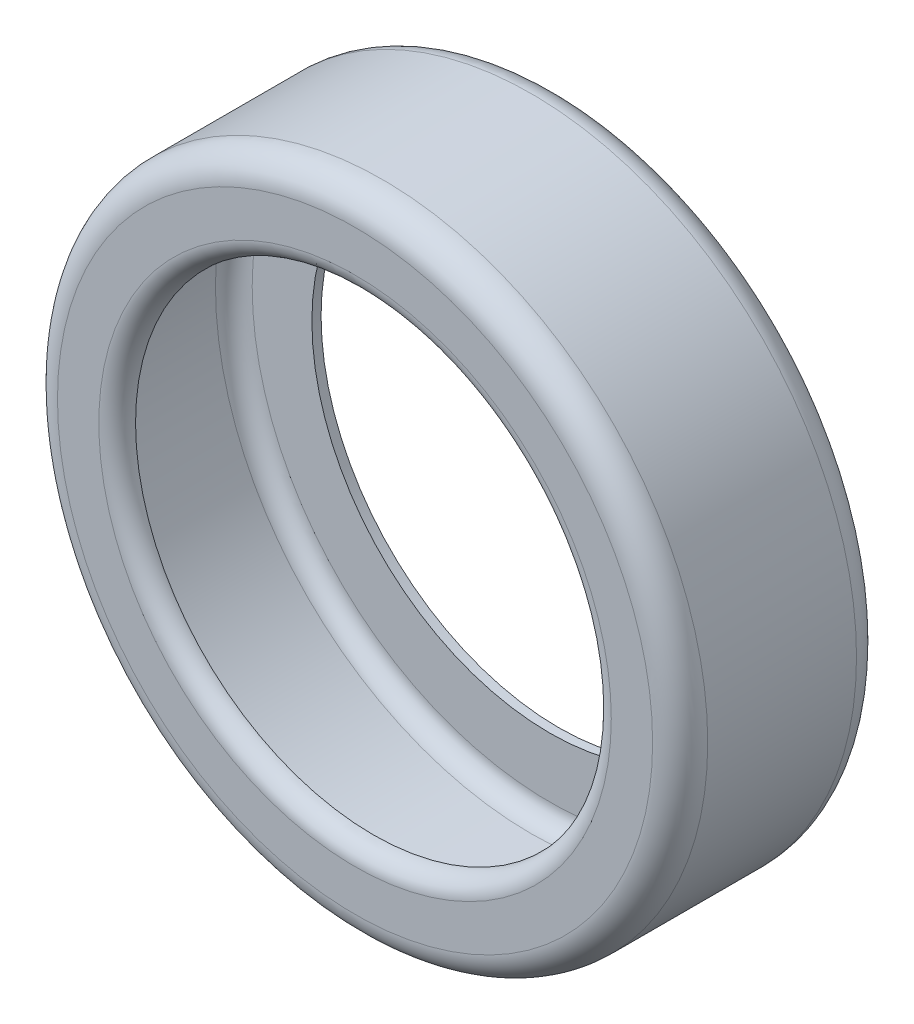
ISO-10303-21;
HEADER;
FILE_DESCRIPTION(('STEP AP214'),'2;1');
FILE_NAME('part.step','',(''),(''),'','','');
FILE_SCHEMA(('AUTOMOTIVE_DESIGN { 1 0 10303 214 1 1 1 1 }'));
ENDSEC;
DATA;
#1=APPLICATION_CONTEXT('core data for automotive mechanical design processes');
#2=APPLICATION_PROTOCOL_DEFINITION('international standard','automotive_design',2000,#1);
#3=PRODUCT_CONTEXT('',#1,'mechanical');
#4=PRODUCT('Part','Part','',(#3));
#5=PRODUCT_RELATED_PRODUCT_CATEGORY('part','',(#4));
#6=PRODUCT_DEFINITION_FORMATION('','',#4);
#7=PRODUCT_DEFINITION_CONTEXT('part definition',#1,'design');
#8=PRODUCT_DEFINITION('design','',#6,#7);
#9=PRODUCT_DEFINITION_SHAPE('','',#8);
#10=(LENGTH_UNIT() NAMED_UNIT(*) SI_UNIT(.MILLI.,.METRE.));
#11=(NAMED_UNIT(*) PLANE_ANGLE_UNIT() SI_UNIT($,.RADIAN.));
#12=(NAMED_UNIT(*) SI_UNIT($,.STERADIAN.) SOLID_ANGLE_UNIT());
#13=UNCERTAINTY_MEASURE_WITH_UNIT(LENGTH_MEASURE(1.E-05),#10,'distance_accuracy_value','');
#14=(GEOMETRIC_REPRESENTATION_CONTEXT(3) GLOBAL_UNCERTAINTY_ASSIGNED_CONTEXT((#13)) GLOBAL_UNIT_ASSIGNED_CONTEXT((#10,
#11,#12)) REPRESENTATION_CONTEXT('',''));
#15=CARTESIAN_POINT('',(0.,0.,0.));
#16=DIRECTION('',(0.,0.,1.));
#17=DIRECTION('',(1.,0.,0.));
#18=AXIS2_PLACEMENT_3D('',#15,#16,#17);
#19=CARTESIAN_POINT('',(0.,0.,222.));
#20=DIRECTION('',(0.,0.,-1.));
#21=DIRECTION('',(-1.,0.,0.));
#22=AXIS2_PLACEMENT_3D('',#19,#20,#21);
#23=CYLINDRICAL_SURFACE('',#22,259.);
#24=CARTESIAN_POINT('',(0.,0.,0.));
#25=DIRECTION('',(0.,0.,1.));
#26=DIRECTION('',(1.,0.,0.));
#27=AXIS2_PLACEMENT_3D('',#24,#25,#26);
#28=CIRCLE('',#27,259.);
#29=CARTESIAN_POINT('',(259.,0.,0.));
#30=VERTEX_POINT('',#29);
#31=EDGE_CURVE('E69',#30,#30,#28,.T.);
#32=ORIENTED_EDGE('',*,*,#31,.F.);
#33=EDGE_LOOP('',(#32));
#34=FACE_BOUND('',#33,.T.);
#35=CARTESIAN_POINT('',(0.,0.,10.));
#36=DIRECTION('',(0.,0.,1.));
#37=DIRECTION('',(1.,0.,0.));
#38=AXIS2_PLACEMENT_3D('',#35,#36,#37);
#39=CIRCLE('',#38,259.);
#40=CARTESIAN_POINT('',(259.,0.,10.));
#41=VERTEX_POINT('',#40);
#42=EDGE_CURVE('E78',#41,#41,#39,.T.);
#43=ORIENTED_EDGE('',*,*,#42,.T.);
#44=EDGE_LOOP('',(#43));
#45=FACE_BOUND('',#44,.T.);
#46=ADVANCED_FACE('F41',(#34,#45),#23,.F.);
#47=CARTESIAN_POINT('',(0.,0.,222.));
#48=DIRECTION('',(0.,0.,1.));
#49=DIRECTION('',(1.,0.,0.));
#50=AXIS2_PLACEMENT_3D('',#47,#48,#49);
#51=PLANE('',#50);
#52=CARTESIAN_POINT('',(0.,0.,222.));
#53=DIRECTION('',(0.,0.,1.));
#54=DIRECTION('',(1.,0.,0.));
#55=AXIS2_PLACEMENT_3D('',#52,#53,#54);
#56=CIRCLE('',#55,279.);
#57=CARTESIAN_POINT('',(279.,0.,222.));
#58=VERTEX_POINT('',#57);
#59=EDGE_CURVE('E10',#58,#58,#56,.F.);
#60=ORIENTED_EDGE('',*,*,#59,.T.);
#61=EDGE_LOOP('',(#60));
#62=FACE_BOUND('',#61,.T.);
#63=CARTESIAN_POINT('',(0.,0.,222.));
#64=DIRECTION('',(0.,0.,1.));
#65=DIRECTION('',(1.,0.,0.));
#66=AXIS2_PLACEMENT_3D('',#63,#64,#65);
#67=CIRCLE('',#66,324.);
#68=CARTESIAN_POINT('',(324.,0.,222.));
#69=VERTEX_POINT('',#68);
#70=EDGE_CURVE('E49',#69,#69,#67,.T.);
#71=ORIENTED_EDGE('',*,*,#70,.T.);
#72=EDGE_LOOP('',(#71));
#73=FACE_BOUND('',#72,.T.);
#74=ADVANCED_FACE('F121',(#62,#73),#51,.T.);
#75=CARTESIAN_POINT('',(0.,0.,0.));
#76=DIRECTION('',(0.,0.,1.));
#77=DIRECTION('',(1.,0.,0.));
#78=AXIS2_PLACEMENT_3D('',#75,#76,#77);
#79=PLANE('',#78);
#80=CARTESIAN_POINT('',(0.,0.,0.));
#81=DIRECTION('',(0.,0.,1.));
#82=DIRECTION('',(1.,0.,0.));
#83=AXIS2_PLACEMENT_3D('',#80,#81,#82);
#84=CIRCLE('',#83,324.);
#85=CARTESIAN_POINT('',(324.,0.,0.));
#86=VERTEX_POINT('',#85);
#87=EDGE_CURVE('E54',#86,#86,#84,.F.);
#88=ORIENTED_EDGE('',*,*,#87,.T.);
#89=EDGE_LOOP('',(#88));
#90=FACE_BOUND('',#89,.T.);
#91=ORIENTED_EDGE('',*,*,#31,.T.);
#92=EDGE_LOOP('',(#91));
#93=FACE_BOUND('',#92,.T.);
#94=ADVANCED_FACE('F127',(#90,#93),#79,.F.);
#95=CARTESIAN_POINT('',(0.,0.,222.));
#96=DIRECTION('',(0.,0.,-1.));
#97=DIRECTION('',(-1.,0.,0.));
#98=AXIS2_PLACEMENT_3D('',#95,#96,#97);
#99=CYLINDRICAL_SURFACE('',#98,354.);
#100=CARTESIAN_POINT('',(0.,0.,30.));
#101=DIRECTION('',(0.,0.,1.));
#102=DIRECTION('',(1.,0.,0.));
#103=AXIS2_PLACEMENT_3D('',#100,#101,#102);
#104=CIRCLE('',#103,354.);
#105=CARTESIAN_POINT('',(354.,0.,30.));
#106=VERTEX_POINT('',#105);
#107=EDGE_CURVE('E59',#106,#106,#104,.T.);
#108=ORIENTED_EDGE('',*,*,#107,.T.);
#109=EDGE_LOOP('',(#108));
#110=FACE_BOUND('',#109,.T.);
#111=CARTESIAN_POINT('',(0.,0.,192.));
#112=DIRECTION('',(0.,0.,1.));
#113=DIRECTION('',(1.,0.,0.));
#114=AXIS2_PLACEMENT_3D('',#111,#112,#113);
#115=CIRCLE('',#114,354.);
#116=CARTESIAN_POINT('',(354.,0.,192.));
#117=VERTEX_POINT('',#116);
#118=EDGE_CURVE('E65',#117,#117,#115,.F.);
#119=ORIENTED_EDGE('',*,*,#118,.T.);
#120=EDGE_LOOP('',(#119));
#121=FACE_BOUND('',#120,.T.);
#122=ADVANCED_FACE('F137',(#110,#121),#99,.T.);
#123=CARTESIAN_POINT('',(0.,0.,30.));
#124=DIRECTION('',(0.,0.,1.));
#125=DIRECTION('',(1.,0.,0.));
#126=AXIS2_PLACEMENT_3D('',#123,#124,#125);
#127=TOROIDAL_SURFACE('',#126,324.,30.);
#128=ORIENTED_EDGE('',*,*,#87,.F.);
#129=EDGE_LOOP('',(#128));
#130=FACE_BOUND('',#129,.T.);
#131=ORIENTED_EDGE('',*,*,#107,.F.);
#132=EDGE_LOOP('',(#131));
#133=FACE_BOUND('',#132,.T.);
#134=ADVANCED_FACE('F118',(#130,#133),#127,.T.);
#135=CARTESIAN_POINT('',(0.,0.,192.));
#136=DIRECTION('',(0.,0.,1.));
#137=DIRECTION('',(1.,0.,0.));
#138=AXIS2_PLACEMENT_3D('',#135,#136,#137);
#139=TOROIDAL_SURFACE('',#138,324.,30.);
#140=ORIENTED_EDGE('',*,*,#118,.F.);
#141=EDGE_LOOP('',(#140));
#142=FACE_BOUND('',#141,.T.);
#143=ORIENTED_EDGE('',*,*,#70,.F.);
#144=EDGE_LOOP('',(#143));
#145=FACE_BOUND('',#144,.T.);
#146=ADVANCED_FACE('F110',(#142,#145),#139,.T.);
#147=CARTESIAN_POINT('',(0.,0.,202.));
#148=DIRECTION('',(0.,0.,1.));
#149=DIRECTION('',(1.,0.,0.));
#150=AXIS2_PLACEMENT_3D('',#147,#148,#149);
#151=TOROIDAL_SURFACE('',#150,279.,20.);
#152=ORIENTED_EDGE('',*,*,#59,.F.);
#153=EDGE_LOOP('',(#152));
#154=FACE_BOUND('',#153,.T.);
#155=CARTESIAN_POINT('',(0.,0.,202.));
#156=DIRECTION('',(0.,0.,1.));
#157=DIRECTION('',(1.,0.,0.));
#158=AXIS2_PLACEMENT_3D('',#155,#156,#157);
#159=CIRCLE('',#158,259.);
#160=CARTESIAN_POINT('',(259.,0.,202.));
#161=VERTEX_POINT('',#160);
#162=EDGE_CURVE('E98',#161,#161,#159,.T.);
#163=ORIENTED_EDGE('',*,*,#162,.F.);
#164=EDGE_LOOP('',(#163));
#165=FACE_BOUND('',#164,.T.);
#166=ADVANCED_FACE('F43',(#154,#165),#151,.T.);
#167=CARTESIAN_POINT('',(0.,0.,202.));
#168=DIRECTION('',(0.,0.,-1.));
#169=DIRECTION('',(-1.,0.,0.));
#170=AXIS2_PLACEMENT_3D('',#167,#168,#169);
#171=PLANE('',#170);
#172=ORIENTED_EDGE('',*,*,#162,.T.);
#173=EDGE_LOOP('',(#172));
#174=FACE_BOUND('',#173,.T.);
#175=CARTESIAN_POINT('',(0.,0.,202.));
#176=DIRECTION('',(0.,0.,1.));
#177=DIRECTION('',(1.,0.,0.));
#178=AXIS2_PLACEMENT_3D('',#175,#176,#177);
#179=CIRCLE('',#178,269.);
#180=CARTESIAN_POINT('',(269.,0.,202.));
#181=VERTEX_POINT('',#180);
#182=EDGE_CURVE('E73',#181,#181,#179,.T.);
#183=ORIENTED_EDGE('',*,*,#182,.F.);
#184=EDGE_LOOP('',(#183));
#185=FACE_BOUND('',#184,.T.);
#186=ADVANCED_FACE('F106',(#174,#185),#171,.T.);
#187=CARTESIAN_POINT('',(0.,0.,212.));
#188=DIRECTION('',(0.,0.,1.));
#189=DIRECTION('',(1.,0.,0.));
#190=AXIS2_PLACEMENT_3D('',#187,#188,#189);
#191=PLANE('',#190);
#192=CARTESIAN_POINT('',(0.,0.,212.));
#193=DIRECTION('',(0.,0.,1.));
#194=DIRECTION('',(1.,0.,0.));
#195=AXIS2_PLACEMENT_3D('',#192,#193,#194);
#196=CIRCLE('',#195,279.);
#197=CARTESIAN_POINT('',(279.,0.,212.));
#198=VERTEX_POINT('',#197);
#199=EDGE_CURVE('E77',#198,#198,#196,.F.);
#200=ORIENTED_EDGE('',*,*,#199,.F.);
#201=EDGE_LOOP('',(#200));
#202=FACE_BOUND('',#201,.T.);
#203=CARTESIAN_POINT('',(0.,0.,212.));
#204=DIRECTION('',(0.,0.,1.));
#205=DIRECTION('',(1.,0.,0.));
#206=AXIS2_PLACEMENT_3D('',#203,#204,#205);
#207=CIRCLE('',#206,324.);
#208=CARTESIAN_POINT('',(324.,0.,212.));
#209=VERTEX_POINT('',#208);
#210=EDGE_CURVE('E87',#209,#209,#207,.T.);
#211=ORIENTED_EDGE('',*,*,#210,.F.);
#212=EDGE_LOOP('',(#211));
#213=FACE_BOUND('',#212,.T.);
#214=ADVANCED_FACE('F116',(#202,#213),#191,.F.);
#215=CARTESIAN_POINT('',(0.,0.,10.));
#216=DIRECTION('',(0.,0.,1.));
#217=DIRECTION('',(1.,0.,0.));
#218=AXIS2_PLACEMENT_3D('',#215,#216,#217);
#219=PLANE('',#218);
#220=CARTESIAN_POINT('',(0.,0.,10.));
#221=DIRECTION('',(0.,0.,1.));
#222=DIRECTION('',(1.,0.,0.));
#223=AXIS2_PLACEMENT_3D('',#220,#221,#222);
#224=CIRCLE('',#223,324.);
#225=CARTESIAN_POINT('',(324.,0.,10.));
#226=VERTEX_POINT('',#225);
#227=EDGE_CURVE('E83',#226,#226,#224,.F.);
#228=ORIENTED_EDGE('',*,*,#227,.F.);
#229=EDGE_LOOP('',(#228));
#230=FACE_BOUND('',#229,.T.);
#231=ORIENTED_EDGE('',*,*,#42,.F.);
#232=EDGE_LOOP('',(#231));
#233=FACE_BOUND('',#232,.T.);
#234=ADVANCED_FACE('F195',(#230,#233),#219,.T.);
#235=CARTESIAN_POINT('',(0.,0.,222.));
#236=DIRECTION('',(0.,0.,-1.));
#237=DIRECTION('',(-1.,0.,0.));
#238=AXIS2_PLACEMENT_3D('',#235,#236,#237);
#239=CYLINDRICAL_SURFACE('',#238,344.);
#240=CARTESIAN_POINT('',(0.,0.,30.));
#241=DIRECTION('',(0.,0.,-1.));
#242=DIRECTION('',(-1.,0.,0.));
#243=AXIS2_PLACEMENT_3D('',#240,#241,#242);
#244=CIRCLE('',#243,344.);
#245=CARTESIAN_POINT('',(-344.,0.,30.));
#246=VERTEX_POINT('',#245);
#247=EDGE_CURVE('E88',#246,#246,#244,.F.);
#248=ORIENTED_EDGE('',*,*,#247,.F.);
#249=EDGE_LOOP('',(#248));
#250=FACE_BOUND('',#249,.T.);
#251=CARTESIAN_POINT('',(0.,0.,192.));
#252=DIRECTION('',(0.,0.,-1.));
#253=DIRECTION('',(-1.,0.,0.));
#254=AXIS2_PLACEMENT_3D('',#251,#252,#253);
#255=CIRCLE('',#254,344.);
#256=CARTESIAN_POINT('',(-344.,0.,192.));
#257=VERTEX_POINT('',#256);
#258=EDGE_CURVE('E82',#257,#257,#255,.T.);
#259=ORIENTED_EDGE('',*,*,#258,.F.);
#260=EDGE_LOOP('',(#259));
#261=FACE_BOUND('',#260,.T.);
#262=ADVANCED_FACE('F205',(#250,#261),#239,.F.);
#263=CARTESIAN_POINT('',(0.,0.,30.));
#264=DIRECTION('',(0.,0.,1.));
#265=DIRECTION('',(1.,0.,0.));
#266=AXIS2_PLACEMENT_3D('',#263,#264,#265);
#267=TOROIDAL_SURFACE('',#266,324.,20.);
#268=ORIENTED_EDGE('',*,*,#227,.T.);
#269=EDGE_LOOP('',(#268));
#270=FACE_BOUND('',#269,.T.);
#271=ORIENTED_EDGE('',*,*,#247,.T.);
#272=EDGE_LOOP('',(#271));
#273=FACE_BOUND('',#272,.T.);
#274=ADVANCED_FACE('F216',(#270,#273),#267,.F.);
#275=CARTESIAN_POINT('',(0.,0.,192.));
#276=DIRECTION('',(0.,0.,1.));
#277=DIRECTION('',(1.,0.,0.));
#278=AXIS2_PLACEMENT_3D('',#275,#276,#277);
#279=TOROIDAL_SURFACE('',#278,324.,20.);
#280=ORIENTED_EDGE('',*,*,#258,.T.);
#281=EDGE_LOOP('',(#280));
#282=FACE_BOUND('',#281,.T.);
#283=ORIENTED_EDGE('',*,*,#210,.T.);
#284=EDGE_LOOP('',(#283));
#285=FACE_BOUND('',#284,.T.);
#286=ADVANCED_FACE('F227',(#282,#285),#279,.F.);
#287=CARTESIAN_POINT('',(0.,0.,202.));
#288=DIRECTION('',(0.,0.,1.));
#289=DIRECTION('',(1.,0.,0.));
#290=AXIS2_PLACEMENT_3D('',#287,#288,#289);
#291=TOROIDAL_SURFACE('',#290,279.,10.);
#292=ORIENTED_EDGE('',*,*,#199,.T.);
#293=EDGE_LOOP('',(#292));
#294=FACE_BOUND('',#293,.T.);
#295=ORIENTED_EDGE('',*,*,#182,.T.);
#296=EDGE_LOOP('',(#295));
#297=FACE_BOUND('',#296,.T.);
#298=ADVANCED_FACE('F132',(#294,#297),#291,.F.);
#299=CLOSED_SHELL('',(#46,#74,#94,#122,#134,#146,#166,#186,#214,#234,#262,#274,#286,#298));
#300=MANIFOLD_SOLID_BREP('B2',#299);
#301=ADVANCED_BREP_SHAPE_REPRESENTATION('',(#18,#300),#14);
#302=SHAPE_DEFINITION_REPRESENTATION(#9,#301);
ENDSEC;
END-ISO-10303-21;
